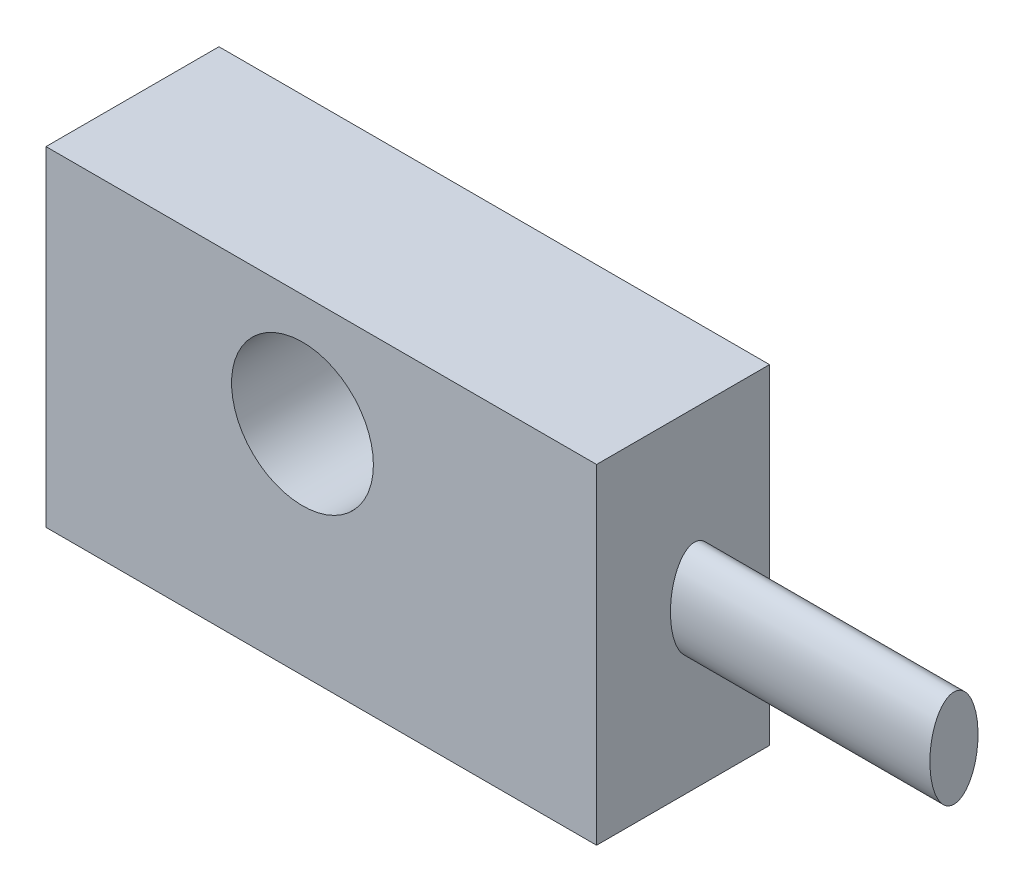
ISO-10303-21;
HEADER;
FILE_DESCRIPTION(('STEP AP214'),'2;1');
FILE_NAME('part.step','',(''),(''),'','','');
FILE_SCHEMA(('AUTOMOTIVE_DESIGN { 1 0 10303 214 1 1 1 1 }'));
ENDSEC;
DATA;
#1=APPLICATION_CONTEXT('core data for automotive mechanical design processes');
#2=APPLICATION_PROTOCOL_DEFINITION('international standard','automotive_design',2000,#1);
#3=PRODUCT_CONTEXT('',#1,'mechanical');
#4=PRODUCT('Part','Part','',(#3));
#5=PRODUCT_RELATED_PRODUCT_CATEGORY('part','',(#4));
#6=PRODUCT_DEFINITION_FORMATION('','',#4);
#7=PRODUCT_DEFINITION_CONTEXT('part definition',#1,'design');
#8=PRODUCT_DEFINITION('design','',#6,#7);
#9=PRODUCT_DEFINITION_SHAPE('','',#8);
#10=(LENGTH_UNIT() NAMED_UNIT(*) SI_UNIT(.MILLI.,.METRE.));
#11=(NAMED_UNIT(*) PLANE_ANGLE_UNIT() SI_UNIT($,.RADIAN.));
#12=(NAMED_UNIT(*) SI_UNIT($,.STERADIAN.) SOLID_ANGLE_UNIT());
#13=UNCERTAINTY_MEASURE_WITH_UNIT(LENGTH_MEASURE(1.E-05),#10,'distance_accuracy_value','');
#14=(GEOMETRIC_REPRESENTATION_CONTEXT(3) GLOBAL_UNCERTAINTY_ASSIGNED_CONTEXT((#13)) GLOBAL_UNIT_ASSIGNED_CONTEXT((#10,
#11,#12)) REPRESENTATION_CONTEXT('',''));
#15=CARTESIAN_POINT('',(0.,0.,0.));
#16=DIRECTION('',(0.,0.,1.));
#17=DIRECTION('',(1.,0.,0.));
#18=AXIS2_PLACEMENT_3D('',#15,#16,#17);
#19=CARTESIAN_POINT('',(80.8621553221599,-48.4364310379738,50.8));
#20=DIRECTION('',(-1.,0.,0.));
#21=DIRECTION('',(0.,0.,1.));
#22=AXIS2_PLACEMENT_3D('',#19,#20,#21);
#23=PLANE('',#22);
#24=CARTESIAN_POINT('',(80.8621553221599,0.,22.0344776257662));
#25=DIRECTION('',(1.,0.,0.));
#26=DIRECTION('',(0.,-1.,0.));
#27=AXIS2_PLACEMENT_3D('',#24,#25,#26);
#28=ELLIPSE('',#27,14.2941015476765,7.07473185002527);
#29=CARTESIAN_POINT('',(80.8621553221599,-14.2941015476765,22.0344776257662));
#30=VERTEX_POINT('',#29);
#31=EDGE_CURVE('E11',#30,#30,#28,.T.);
#32=ORIENTED_EDGE('',*,*,#31,.F.);
#33=EDGE_LOOP('',(#32));
#34=FACE_BOUND('',#33,.T.);
#35=DIRECTION('',(0.,1.,0.));
#36=VECTOR('',#35,1.);
#37=CARTESIAN_POINT('',(80.8621553221599,-48.4364310379738,0.));
#38=LINE('',#37,#36);
#39=CARTESIAN_POINT('',(80.8621553221599,-48.4364310379738,0.));
#40=VERTEX_POINT('',#39);
#41=CARTESIAN_POINT('',(80.8621553221599,48.4364310379738,0.));
#42=VERTEX_POINT('',#41);
#43=EDGE_CURVE('E101',#40,#42,#38,.T.);
#44=ORIENTED_EDGE('',*,*,#43,.T.);
#45=DIRECTION('',(0.,0.,-1.));
#46=VECTOR('',#45,1.);
#47=CARTESIAN_POINT('',(80.8621553221599,48.4364310379738,50.8));
#48=LINE('',#47,#46);
#49=CARTESIAN_POINT('',(80.8621553221599,48.4364310379738,50.8));
#50=VERTEX_POINT('',#49);
#51=EDGE_CURVE('E43',#50,#42,#48,.T.);
#52=ORIENTED_EDGE('',*,*,#51,.F.);
#53=DIRECTION('',(0.,1.,0.));
#54=VECTOR('',#53,1.);
#55=CARTESIAN_POINT('',(80.8621553221599,-48.4364310379738,50.8));
#56=LINE('',#55,#54);
#57=CARTESIAN_POINT('',(80.8621553221599,-48.4364310379738,50.8));
#58=VERTEX_POINT('',#57);
#59=EDGE_CURVE('E87',#58,#50,#56,.T.);
#60=ORIENTED_EDGE('',*,*,#59,.F.);
#61=DIRECTION('',(0.,0.,-1.));
#62=VECTOR('',#61,1.);
#63=CARTESIAN_POINT('',(80.8621553221599,-48.4364310379738,50.8));
#64=LINE('',#63,#62);
#65=EDGE_CURVE('E97',#58,#40,#64,.T.);
#66=ORIENTED_EDGE('',*,*,#65,.T.);
#67=EDGE_LOOP('',(#44,#52,#60,#66));
#68=FACE_BOUND('',#67,.T.);
#69=ADVANCED_FACE('F35',(#34,#68),#23,.F.);
#70=CARTESIAN_POINT('',(-80.8621553221599,48.4364310379738,50.8));
#71=DIRECTION('',(0.,-1.,0.));
#72=DIRECTION('',(0.,0.,-1.));
#73=AXIS2_PLACEMENT_3D('',#70,#71,#72);
#74=PLANE('',#73);
#75=DIRECTION('',(-1.,0.,0.));
#76=VECTOR('',#75,1.);
#77=CARTESIAN_POINT('',(-80.8621553221599,48.4364310379738,0.));
#78=LINE('',#77,#76);
#79=CARTESIAN_POINT('',(-80.8621553221599,48.4364310379738,0.));
#80=VERTEX_POINT('',#79);
#81=EDGE_CURVE('E92',#42,#80,#78,.T.);
#82=ORIENTED_EDGE('',*,*,#81,.T.);
#83=DIRECTION('',(0.,0.,-1.));
#84=VECTOR('',#83,1.);
#85=CARTESIAN_POINT('',(-80.8621553221599,48.4364310379738,50.8));
#86=LINE('',#85,#84);
#87=CARTESIAN_POINT('',(-80.8621553221599,48.4364310379738,50.8));
#88=VERTEX_POINT('',#87);
#89=EDGE_CURVE('E90',#88,#80,#86,.T.);
#90=ORIENTED_EDGE('',*,*,#89,.F.);
#91=DIRECTION('',(-1.,0.,0.));
#92=VECTOR('',#91,1.);
#93=CARTESIAN_POINT('',(-80.8621553221599,48.4364310379738,50.8));
#94=LINE('',#93,#92);
#95=EDGE_CURVE('E82',#50,#88,#94,.T.);
#96=ORIENTED_EDGE('',*,*,#95,.F.);
#97=ORIENTED_EDGE('',*,*,#51,.T.);
#98=EDGE_LOOP('',(#82,#90,#96,#97));
#99=FACE_BOUND('',#98,.T.);
#100=ADVANCED_FACE('F91',(#99),#74,.F.);
#101=CARTESIAN_POINT('',(-80.8621553221599,-48.4364310379738,50.8));
#102=DIRECTION('',(1.,0.,0.));
#103=DIRECTION('',(0.,0.,-1.));
#104=AXIS2_PLACEMENT_3D('',#101,#102,#103);
#105=PLANE('',#104);
#106=DIRECTION('',(0.,-1.,0.));
#107=VECTOR('',#106,1.);
#108=CARTESIAN_POINT('',(-80.8621553221599,-48.4364310379738,0.));
#109=LINE('',#108,#107);
#110=CARTESIAN_POINT('',(-80.8621553221599,-48.4364310379738,0.));
#111=VERTEX_POINT('',#110);
#112=EDGE_CURVE('E68',#80,#111,#109,.T.);
#113=ORIENTED_EDGE('',*,*,#112,.T.);
#114=DIRECTION('',(0.,0.,-1.));
#115=VECTOR('',#114,1.);
#116=CARTESIAN_POINT('',(-80.8621553221599,-48.4364310379738,50.8));
#117=LINE('',#116,#115);
#118=CARTESIAN_POINT('',(-80.8621553221599,-48.4364310379738,50.8));
#119=VERTEX_POINT('',#118);
#120=EDGE_CURVE('E93',#119,#111,#117,.T.);
#121=ORIENTED_EDGE('',*,*,#120,.F.);
#122=DIRECTION('',(0.,-1.,0.));
#123=VECTOR('',#122,1.);
#124=CARTESIAN_POINT('',(-80.8621553221599,-48.4364310379738,50.8));
#125=LINE('',#124,#123);
#126=EDGE_CURVE('E85',#88,#119,#125,.T.);
#127=ORIENTED_EDGE('',*,*,#126,.F.);
#128=ORIENTED_EDGE('',*,*,#89,.T.);
#129=EDGE_LOOP('',(#113,#121,#127,#128));
#130=FACE_BOUND('',#129,.T.);
#131=ADVANCED_FACE('F95',(#130),#105,.F.);
#132=CARTESIAN_POINT('',(-80.8621553221599,-48.4364310379738,50.8));
#133=DIRECTION('',(0.,1.,0.));
#134=DIRECTION('',(0.,0.,1.));
#135=AXIS2_PLACEMENT_3D('',#132,#133,#134);
#136=PLANE('',#135);
#137=DIRECTION('',(1.,0.,0.));
#138=VECTOR('',#137,1.);
#139=CARTESIAN_POINT('',(-80.8621553221599,-48.4364310379738,0.));
#140=LINE('',#139,#138);
#141=EDGE_CURVE('E74',#111,#40,#140,.T.);
#142=ORIENTED_EDGE('',*,*,#141,.T.);
#143=ORIENTED_EDGE('',*,*,#65,.F.);
#144=DIRECTION('',(1.,0.,0.));
#145=VECTOR('',#144,1.);
#146=CARTESIAN_POINT('',(-80.8621553221599,-48.4364310379738,50.8));
#147=LINE('',#146,#145);
#148=EDGE_CURVE('E51',#119,#58,#147,.T.);
#149=ORIENTED_EDGE('',*,*,#148,.F.);
#150=ORIENTED_EDGE('',*,*,#120,.T.);
#151=EDGE_LOOP('',(#142,#143,#149,#150));
#152=FACE_BOUND('',#151,.T.);
#153=ADVANCED_FACE('F124',(#152),#136,.F.);
#154=CARTESIAN_POINT('',(0.,0.,50.8));
#155=DIRECTION('',(0.,0.,-1.));
#156=DIRECTION('',(-1.,0.,0.));
#157=AXIS2_PLACEMENT_3D('',#154,#155,#156);
#158=PLANE('',#157);
#159=CARTESIAN_POINT('',(-5.52569451349427,15.5604826372837,50.8));
#160=DIRECTION('',(0.,0.,1.));
#161=DIRECTION('',(1.,0.,0.));
#162=AXIS2_PLACEMENT_3D('',#159,#160,#161);
#163=CIRCLE('',#162,20.8310043615839);
#164=CARTESIAN_POINT('',(15.3053098480896,15.5604826372837,50.8));
#165=VERTEX_POINT('',#164);
#166=EDGE_CURVE('E152',#165,#165,#163,.T.);
#167=ORIENTED_EDGE('',*,*,#166,.F.);
#168=EDGE_LOOP('',(#167));
#169=FACE_BOUND('',#168,.T.);
#170=ORIENTED_EDGE('',*,*,#59,.T.);
#171=ORIENTED_EDGE('',*,*,#95,.T.);
#172=ORIENTED_EDGE('',*,*,#126,.T.);
#173=ORIENTED_EDGE('',*,*,#148,.T.);
#174=EDGE_LOOP('',(#170,#171,#172,#173));
#175=FACE_BOUND('',#174,.T.);
#176=ADVANCED_FACE('F83',(#169,#175),#158,.F.);
#177=CARTESIAN_POINT('',(0.,0.,0.));
#178=DIRECTION('',(0.,0.,-1.));
#179=DIRECTION('',(-1.,0.,0.));
#180=AXIS2_PLACEMENT_3D('',#177,#178,#179);
#181=PLANE('',#180);
#182=CARTESIAN_POINT('',(-5.52569451349427,15.5604826372837,0.));
#183=DIRECTION('',(0.,0.,1.));
#184=DIRECTION('',(1.,0.,0.));
#185=AXIS2_PLACEMENT_3D('',#182,#183,#184);
#186=CIRCLE('',#185,20.8310043615839);
#187=CARTESIAN_POINT('',(15.3053098480896,15.5604826372837,0.));
#188=VERTEX_POINT('',#187);
#189=EDGE_CURVE('E104',#188,#188,#186,.T.);
#190=ORIENTED_EDGE('',*,*,#189,.T.);
#191=EDGE_LOOP('',(#190));
#192=FACE_BOUND('',#191,.T.);
#193=ORIENTED_EDGE('',*,*,#43,.F.);
#194=ORIENTED_EDGE('',*,*,#141,.F.);
#195=ORIENTED_EDGE('',*,*,#112,.F.);
#196=ORIENTED_EDGE('',*,*,#81,.F.);
#197=EDGE_LOOP('',(#193,#194,#195,#196));
#198=FACE_BOUND('',#197,.T.);
#199=ADVANCED_FACE('F112',(#192,#198),#181,.T.);
#200=CARTESIAN_POINT('',(-5.52569451349427,15.5604826372837,0.));
#201=DIRECTION('',(0.,0.,1.));
#202=DIRECTION('',(1.,0.,0.));
#203=AXIS2_PLACEMENT_3D('',#200,#201,#202);
#204=CYLINDRICAL_SURFACE('',#203,20.8310043615839);
#205=ORIENTED_EDGE('',*,*,#189,.F.);
#206=EDGE_LOOP('',(#205));
#207=FACE_BOUND('',#206,.T.);
#208=ORIENTED_EDGE('',*,*,#166,.T.);
#209=EDGE_LOOP('',(#208));
#210=FACE_BOUND('',#209,.T.);
#211=ADVANCED_FACE('F114',(#207,#210),#204,.F.);
#212=CARTESIAN_POINT('',(157.06215532216,0.,22.0344776257662));
#213=DIRECTION('',(1.,0.,0.));
#214=DIRECTION('',(0.,-1.,0.));
#215=AXIS2_PLACEMENT_3D('',#212,#213,#214);
#216=ELLIPSE('',#215,14.2941015476765,7.07473185002527);
#217=DIRECTION('',(-1.,0.,0.));
#218=VECTOR('',#217,1.);
#219=SURFACE_OF_LINEAR_EXTRUSION('',#216,#218);
#220=CARTESIAN_POINT('',(157.06215532216,-14.2941015476765,22.0344776257662));
#221=VERTEX_POINT('',#220);
#222=EDGE_CURVE('E148',#221,#221,#216,.T.);
#223=ORIENTED_EDGE('',*,*,#222,.F.);
#224=EDGE_LOOP('',(#223));
#225=FACE_BOUND('',#224,.T.);
#226=ORIENTED_EDGE('',*,*,#31,.T.);
#227=EDGE_LOOP('',(#226));
#228=FACE_BOUND('',#227,.T.);
#229=ADVANCED_FACE('F121',(#225,#228),#219,.F.);
#230=CARTESIAN_POINT('',(157.06215532216,0.,22.0344776257662));
#231=DIRECTION('',(1.,0.,0.));
#232=DIRECTION('',(0.,0.,-1.));
#233=AXIS2_PLACEMENT_3D('',#230,#231,#232);
#234=PLANE('',#233);
#235=ORIENTED_EDGE('',*,*,#222,.T.);
#236=EDGE_LOOP('',(#235));
#237=FACE_BOUND('',#236,.T.);
#238=ADVANCED_FACE('F139',(#237),#234,.T.);
#239=CLOSED_SHELL('',(#69,#100,#131,#153,#176,#199,#211,#229,#238));
#240=MANIFOLD_SOLID_BREP('B2',#239);
#241=ADVANCED_BREP_SHAPE_REPRESENTATION('',(#18,#240),#14);
#242=SHAPE_DEFINITION_REPRESENTATION(#9,#241);
ENDSEC;
END-ISO-10303-21;
